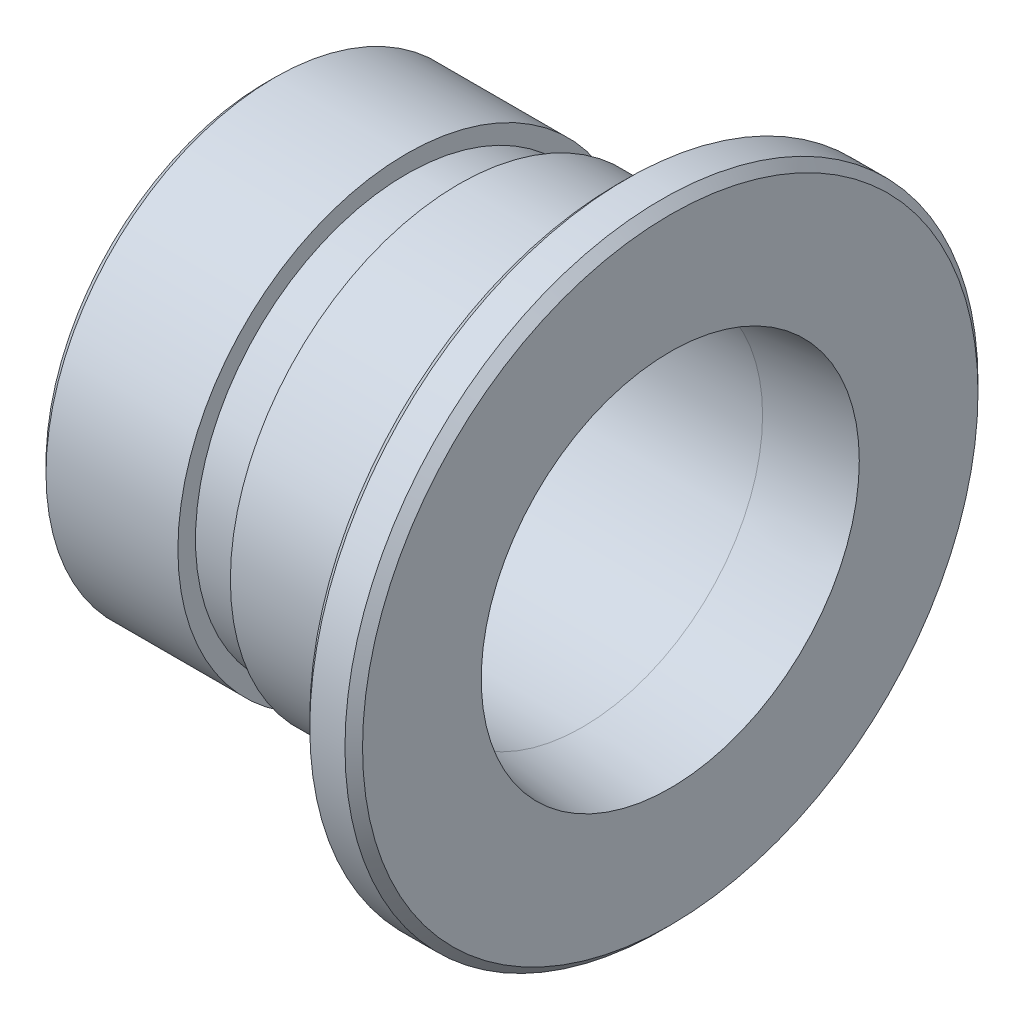
ISO-10303-21;
HEADER;
FILE_DESCRIPTION(('STEP AP214'),'2;1');
FILE_NAME('part.step','',(''),(''),'','','');
FILE_SCHEMA(('AUTOMOTIVE_DESIGN { 1 0 10303 214 1 1 1 1 }'));
ENDSEC;
DATA;
#1=APPLICATION_CONTEXT('core data for automotive mechanical design processes');
#2=APPLICATION_PROTOCOL_DEFINITION('international standard','automotive_design',2000,#1);
#3=PRODUCT_CONTEXT('',#1,'mechanical');
#4=PRODUCT('Part','Part','',(#3));
#5=PRODUCT_RELATED_PRODUCT_CATEGORY('part','',(#4));
#6=PRODUCT_DEFINITION_FORMATION('','',#4);
#7=PRODUCT_DEFINITION_CONTEXT('part definition',#1,'design');
#8=PRODUCT_DEFINITION('design','',#6,#7);
#9=PRODUCT_DEFINITION_SHAPE('','',#8);
#10=(LENGTH_UNIT() NAMED_UNIT(*) SI_UNIT(.MILLI.,.METRE.));
#11=(NAMED_UNIT(*) PLANE_ANGLE_UNIT() SI_UNIT($,.RADIAN.));
#12=(NAMED_UNIT(*) SI_UNIT($,.STERADIAN.) SOLID_ANGLE_UNIT());
#13=UNCERTAINTY_MEASURE_WITH_UNIT(LENGTH_MEASURE(1.E-05),#10,'distance_accuracy_value','');
#14=(GEOMETRIC_REPRESENTATION_CONTEXT(3) GLOBAL_UNCERTAINTY_ASSIGNED_CONTEXT((#13)) GLOBAL_UNIT_ASSIGNED_CONTEXT((#10,
#11,#12)) REPRESENTATION_CONTEXT('',''));
#15=CARTESIAN_POINT('',(0.,0.,0.));
#16=DIRECTION('',(0.,0.,1.));
#17=DIRECTION('',(1.,0.,0.));
#18=AXIS2_PLACEMENT_3D('',#15,#16,#17);
#19=CARTESIAN_POINT('',(0.,0.,0.));
#20=DIRECTION('',(1.,0.,0.));
#21=DIRECTION('',(0.,0.,-1.));
#22=AXIS2_PLACEMENT_3D('',#19,#20,#21);
#23=CYLINDRICAL_SURFACE('',#22,13.);
#24=CARTESIAN_POINT('',(-12.0158016342766,0.,0.));
#25=DIRECTION('',(1.,0.,0.));
#26=DIRECTION('',(0.,0.,-1.));
#27=AXIS2_PLACEMENT_3D('',#24,#25,#26);
#28=CIRCLE('',#27,13.);
#29=CARTESIAN_POINT('',(-12.0158016342766,0.,-13.));
#30=VERTEX_POINT('',#29);
#31=EDGE_CURVE('E94',#30,#30,#28,.T.);
#32=ORIENTED_EDGE('',*,*,#31,.T.);
#33=EDGE_LOOP('',(#32));
#34=FACE_BOUND('',#33,.T.);
#35=CARTESIAN_POINT('',(-3.,0.,0.));
#36=DIRECTION('',(1.,0.,0.));
#37=DIRECTION('',(0.,0.,-1.));
#38=AXIS2_PLACEMENT_3D('',#35,#36,#37);
#39=CIRCLE('',#38,13.);
#40=CARTESIAN_POINT('',(-3.,0.,-13.));
#41=VERTEX_POINT('',#40);
#42=EDGE_CURVE('E12',#41,#41,#39,.T.);
#43=ORIENTED_EDGE('',*,*,#42,.F.);
#44=EDGE_LOOP('',(#43));
#45=FACE_BOUND('',#44,.T.);
#46=ADVANCED_FACE('F45',(#34,#45),#23,.T.);
#47=CARTESIAN_POINT('',(-3.,17.5,0.));
#48=DIRECTION('',(-1.,0.,0.));
#49=DIRECTION('',(0.,0.,1.));
#50=AXIS2_PLACEMENT_3D('',#47,#48,#49);
#51=PLANE('',#50);
#52=ORIENTED_EDGE('',*,*,#42,.T.);
#53=EDGE_LOOP('',(#52));
#54=FACE_BOUND('',#53,.T.);
#55=CARTESIAN_POINT('',(-3.,0.,0.));
#56=DIRECTION('',(1.,0.,0.));
#57=DIRECTION('',(0.,0.,-1.));
#58=AXIS2_PLACEMENT_3D('',#55,#56,#57);
#59=CIRCLE('',#58,17.5);
#60=CARTESIAN_POINT('',(-3.,0.,-17.5));
#61=VERTEX_POINT('',#60);
#62=EDGE_CURVE('E51',#61,#61,#59,.T.);
#63=ORIENTED_EDGE('',*,*,#62,.F.);
#64=EDGE_LOOP('',(#63));
#65=FACE_BOUND('',#64,.T.);
#66=ADVANCED_FACE('F112',(#54,#65),#51,.T.);
#67=CARTESIAN_POINT('',(-2.5,0.,0.));
#68=DIRECTION('',(1.,0.,0.));
#69=DIRECTION('',(0.,0.,-1.));
#70=AXIS2_PLACEMENT_3D('',#67,#68,#69);
#71=CONICAL_SURFACE('',#70,18.,0.785398163397449);
#72=ORIENTED_EDGE('',*,*,#62,.T.);
#73=EDGE_LOOP('',(#72));
#74=FACE_BOUND('',#73,.T.);
#75=CARTESIAN_POINT('',(-2.5,0.,0.));
#76=DIRECTION('',(1.,0.,0.));
#77=DIRECTION('',(0.,0.,-1.));
#78=AXIS2_PLACEMENT_3D('',#75,#76,#77);
#79=CIRCLE('',#78,18.);
#80=CARTESIAN_POINT('',(-2.5,0.,-18.));
#81=VERTEX_POINT('',#80);
#82=EDGE_CURVE('E55',#81,#81,#79,.T.);
#83=ORIENTED_EDGE('',*,*,#82,.F.);
#84=EDGE_LOOP('',(#83));
#85=FACE_BOUND('',#84,.T.);
#86=ADVANCED_FACE('F116',(#74,#85),#71,.T.);
#87=CARTESIAN_POINT('',(0.,0.,0.));
#88=DIRECTION('',(1.,0.,0.));
#89=DIRECTION('',(0.,0.,-1.));
#90=AXIS2_PLACEMENT_3D('',#87,#88,#89);
#91=CYLINDRICAL_SURFACE('',#90,18.);
#92=ORIENTED_EDGE('',*,*,#82,.T.);
#93=EDGE_LOOP('',(#92));
#94=FACE_BOUND('',#93,.T.);
#95=CARTESIAN_POINT('',(-0.5,0.,0.));
#96=DIRECTION('',(1.,0.,0.));
#97=DIRECTION('',(0.,0.,-1.));
#98=AXIS2_PLACEMENT_3D('',#95,#96,#97);
#99=CIRCLE('',#98,18.);
#100=CARTESIAN_POINT('',(-0.5,0.,-18.));
#101=VERTEX_POINT('',#100);
#102=EDGE_CURVE('E59',#101,#101,#99,.T.);
#103=ORIENTED_EDGE('',*,*,#102,.F.);
#104=EDGE_LOOP('',(#103));
#105=FACE_BOUND('',#104,.T.);
#106=ADVANCED_FACE('F120',(#94,#105),#91,.T.);
#107=CARTESIAN_POINT('',(0.,0.,0.));
#108=DIRECTION('',(-1.,0.,0.));
#109=DIRECTION('',(0.,0.,1.));
#110=AXIS2_PLACEMENT_3D('',#107,#108,#109);
#111=CONICAL_SURFACE('',#110,17.5,0.785398163397449);
#112=ORIENTED_EDGE('',*,*,#102,.T.);
#113=EDGE_LOOP('',(#112));
#114=FACE_BOUND('',#113,.T.);
#115=CARTESIAN_POINT('',(0.,0.,0.));
#116=DIRECTION('',(1.,0.,0.));
#117=DIRECTION('',(0.,0.,-1.));
#118=AXIS2_PLACEMENT_3D('',#115,#116,#117);
#119=CIRCLE('',#118,17.5);
#120=CARTESIAN_POINT('',(0.,0.,-17.5));
#121=VERTEX_POINT('',#120);
#122=EDGE_CURVE('E64',#121,#121,#119,.T.);
#123=ORIENTED_EDGE('',*,*,#122,.F.);
#124=EDGE_LOOP('',(#123));
#125=FACE_BOUND('',#124,.T.);
#126=ADVANCED_FACE('F126',(#114,#125),#111,.T.);
#127=CARTESIAN_POINT('',(0.,10.75,0.));
#128=DIRECTION('',(1.,0.,0.));
#129=DIRECTION('',(0.,0.,-1.));
#130=AXIS2_PLACEMENT_3D('',#127,#128,#129);
#131=PLANE('',#130);
#132=ORIENTED_EDGE('',*,*,#122,.T.);
#133=EDGE_LOOP('',(#132));
#134=FACE_BOUND('',#133,.T.);
#135=CARTESIAN_POINT('',(0.,0.,0.));
#136=DIRECTION('',(1.,0.,0.));
#137=DIRECTION('',(0.,0.,-1.));
#138=AXIS2_PLACEMENT_3D('',#135,#136,#137);
#139=CIRCLE('',#138,10.75);
#140=CARTESIAN_POINT('',(0.,0.,-10.75));
#141=VERTEX_POINT('',#140);
#142=EDGE_CURVE('E67',#141,#141,#139,.T.);
#143=ORIENTED_EDGE('',*,*,#142,.F.);
#144=EDGE_LOOP('',(#143));
#145=FACE_BOUND('',#144,.T.);
#146=ADVANCED_FACE('F130',(#134,#145),#131,.T.);
#147=CARTESIAN_POINT('',(-5.,0.,0.));
#148=DIRECTION('',(1.,0.,0.));
#149=DIRECTION('',(0.,0.,-1.));
#150=AXIS2_PLACEMENT_3D('',#147,#148,#149);
#151=CONICAL_SURFACE('',#150,10.25,0.0996686524911638);
#152=ORIENTED_EDGE('',*,*,#142,.T.);
#153=EDGE_LOOP('',(#152));
#154=FACE_BOUND('',#153,.T.);
#155=CARTESIAN_POINT('',(-5.,0.,0.));
#156=DIRECTION('',(1.,0.,0.));
#157=DIRECTION('',(0.,0.,-1.));
#158=AXIS2_PLACEMENT_3D('',#155,#156,#157);
#159=CIRCLE('',#158,10.25);
#160=CARTESIAN_POINT('',(-5.,0.,-10.25));
#161=VERTEX_POINT('',#160);
#162=EDGE_CURVE('E70',#161,#161,#159,.T.);
#163=ORIENTED_EDGE('',*,*,#162,.F.);
#164=EDGE_LOOP('',(#163));
#165=FACE_BOUND('',#164,.T.);
#166=ADVANCED_FACE('F134',(#154,#165),#151,.F.);
#167=CARTESIAN_POINT('',(0.,0.,0.));
#168=DIRECTION('',(1.,0.,0.));
#169=DIRECTION('',(0.,0.,-1.));
#170=AXIS2_PLACEMENT_3D('',#167,#168,#169);
#171=CYLINDRICAL_SURFACE('',#170,10.25);
#172=ORIENTED_EDGE('',*,*,#162,.T.);
#173=EDGE_LOOP('',(#172));
#174=FACE_BOUND('',#173,.T.);
#175=CARTESIAN_POINT('',(-18.,0.,0.));
#176=DIRECTION('',(1.,0.,0.));
#177=DIRECTION('',(0.,0.,-1.));
#178=AXIS2_PLACEMENT_3D('',#175,#176,#177);
#179=CIRCLE('',#178,10.25);
#180=CARTESIAN_POINT('',(-18.,0.,-10.25));
#181=VERTEX_POINT('',#180);
#182=EDGE_CURVE('E73',#181,#181,#179,.T.);
#183=ORIENTED_EDGE('',*,*,#182,.F.);
#184=EDGE_LOOP('',(#183));
#185=FACE_BOUND('',#184,.T.);
#186=ADVANCED_FACE('F138',(#174,#185),#171,.F.);
#187=CARTESIAN_POINT('',(-23.,0.,0.));
#188=DIRECTION('',(-1.,0.,0.));
#189=DIRECTION('',(0.,0.,1.));
#190=AXIS2_PLACEMENT_3D('',#187,#188,#189);
#191=CONICAL_SURFACE('',#190,10.75,0.0996686524911635);
#192=ORIENTED_EDGE('',*,*,#182,.T.);
#193=EDGE_LOOP('',(#192));
#194=FACE_BOUND('',#193,.T.);
#195=CARTESIAN_POINT('',(-23.,0.,0.));
#196=DIRECTION('',(1.,0.,0.));
#197=DIRECTION('',(0.,0.,-1.));
#198=AXIS2_PLACEMENT_3D('',#195,#196,#197);
#199=CIRCLE('',#198,10.75);
#200=CARTESIAN_POINT('',(-23.,0.,-10.75));
#201=VERTEX_POINT('',#200);
#202=EDGE_CURVE('E76',#201,#201,#199,.T.);
#203=ORIENTED_EDGE('',*,*,#202,.F.);
#204=EDGE_LOOP('',(#203));
#205=FACE_BOUND('',#204,.T.);
#206=ADVANCED_FACE('F142',(#194,#205),#191,.F.);
#207=CARTESIAN_POINT('',(-23.,12.5,0.));
#208=DIRECTION('',(-1.,0.,0.));
#209=DIRECTION('',(0.,0.,1.));
#210=AXIS2_PLACEMENT_3D('',#207,#208,#209);
#211=PLANE('',#210);
#212=ORIENTED_EDGE('',*,*,#202,.T.);
#213=EDGE_LOOP('',(#212));
#214=FACE_BOUND('',#213,.T.);
#215=CARTESIAN_POINT('',(-23.,0.,0.));
#216=DIRECTION('',(1.,0.,0.));
#217=DIRECTION('',(0.,0.,-1.));
#218=AXIS2_PLACEMENT_3D('',#215,#216,#217);
#219=CIRCLE('',#218,12.5);
#220=CARTESIAN_POINT('',(-23.,0.,-12.5));
#221=VERTEX_POINT('',#220);
#222=EDGE_CURVE('E79',#221,#221,#219,.T.);
#223=ORIENTED_EDGE('',*,*,#222,.F.);
#224=EDGE_LOOP('',(#223));
#225=FACE_BOUND('',#224,.T.);
#226=ADVANCED_FACE('F146',(#214,#225),#211,.T.);
#227=CARTESIAN_POINT('',(-22.5,0.,0.));
#228=DIRECTION('',(1.,0.,0.));
#229=DIRECTION('',(0.,0.,-1.));
#230=AXIS2_PLACEMENT_3D('',#227,#228,#229);
#231=CONICAL_SURFACE('',#230,13.,0.785398163397448);
#232=ORIENTED_EDGE('',*,*,#222,.T.);
#233=EDGE_LOOP('',(#232));
#234=FACE_BOUND('',#233,.T.);
#235=CARTESIAN_POINT('',(-22.5,0.,0.));
#236=DIRECTION('',(1.,0.,0.));
#237=DIRECTION('',(0.,0.,-1.));
#238=AXIS2_PLACEMENT_3D('',#235,#236,#237);
#239=CIRCLE('',#238,13.);
#240=CARTESIAN_POINT('',(-22.5,0.,-13.));
#241=VERTEX_POINT('',#240);
#242=EDGE_CURVE('E82',#241,#241,#239,.T.);
#243=ORIENTED_EDGE('',*,*,#242,.F.);
#244=EDGE_LOOP('',(#243));
#245=FACE_BOUND('',#244,.T.);
#246=ADVANCED_FACE('F150',(#234,#245),#231,.T.);
#247=CARTESIAN_POINT('',(0.,0.,0.));
#248=DIRECTION('',(1.,0.,0.));
#249=DIRECTION('',(0.,0.,-1.));
#250=AXIS2_PLACEMENT_3D('',#247,#248,#249);
#251=CYLINDRICAL_SURFACE('',#250,13.);
#252=ORIENTED_EDGE('',*,*,#242,.T.);
#253=EDGE_LOOP('',(#252));
#254=FACE_BOUND('',#253,.T.);
#255=CARTESIAN_POINT('',(-15.,0.,0.));
#256=DIRECTION('',(1.,0.,0.));
#257=DIRECTION('',(0.,0.,-1.));
#258=AXIS2_PLACEMENT_3D('',#255,#256,#257);
#259=CIRCLE('',#258,13.);
#260=CARTESIAN_POINT('',(-15.,0.,-13.));
#261=VERTEX_POINT('',#260);
#262=EDGE_CURVE('E85',#261,#261,#259,.T.);
#263=ORIENTED_EDGE('',*,*,#262,.F.);
#264=EDGE_LOOP('',(#263));
#265=FACE_BOUND('',#264,.T.);
#266=ADVANCED_FACE('F154',(#254,#265),#251,.T.);
#267=CARTESIAN_POINT('',(-15.,12.,0.));
#268=DIRECTION('',(1.,0.,0.));
#269=DIRECTION('',(0.,0.,-1.));
#270=AXIS2_PLACEMENT_3D('',#267,#268,#269);
#271=PLANE('',#270);
#272=ORIENTED_EDGE('',*,*,#262,.T.);
#273=EDGE_LOOP('',(#272));
#274=FACE_BOUND('',#273,.T.);
#275=CARTESIAN_POINT('',(-15.,0.,0.));
#276=DIRECTION('',(1.,0.,0.));
#277=DIRECTION('',(0.,0.,-1.));
#278=AXIS2_PLACEMENT_3D('',#275,#276,#277);
#279=CIRCLE('',#278,12.);
#280=CARTESIAN_POINT('',(-15.,0.,-12.));
#281=VERTEX_POINT('',#280);
#282=EDGE_CURVE('E88',#281,#281,#279,.T.);
#283=ORIENTED_EDGE('',*,*,#282,.F.);
#284=EDGE_LOOP('',(#283));
#285=FACE_BOUND('',#284,.T.);
#286=ADVANCED_FACE('F108',(#274,#285),#271,.T.);
#287=CARTESIAN_POINT('',(0.,0.,0.));
#288=DIRECTION('',(1.,0.,0.));
#289=DIRECTION('',(0.,0.,-1.));
#290=AXIS2_PLACEMENT_3D('',#287,#288,#289);
#291=CYLINDRICAL_SURFACE('',#290,12.);
#292=ORIENTED_EDGE('',*,*,#282,.T.);
#293=EDGE_LOOP('',(#292));
#294=FACE_BOUND('',#293,.T.);
#295=CARTESIAN_POINT('',(-11.9841983657234,0.,0.));
#296=DIRECTION('',(1.,0.,0.));
#297=DIRECTION('',(0.,0.,-1.));
#298=AXIS2_PLACEMENT_3D('',#295,#296,#297);
#299=CIRCLE('',#298,12.);
#300=CARTESIAN_POINT('',(-11.9841983657234,0.,-12.));
#301=VERTEX_POINT('',#300);
#302=EDGE_CURVE('E91',#301,#301,#299,.T.);
#303=ORIENTED_EDGE('',*,*,#302,.F.);
#304=EDGE_LOOP('',(#303));
#305=FACE_BOUND('',#304,.T.);
#306=ADVANCED_FACE('F102',(#294,#305),#291,.T.);
#307=CARTESIAN_POINT('',(-12.0158016342766,0.,0.));
#308=DIRECTION('',(-1.,0.,0.));
#309=DIRECTION('',(0.,0.,1.));
#310=AXIS2_PLACEMENT_3D('',#307,#308,#309);
#311=CONICAL_SURFACE('',#310,13.,1.53920357337056);
#312=ORIENTED_EDGE('',*,*,#302,.T.);
#313=EDGE_LOOP('',(#312));
#314=FACE_BOUND('',#313,.T.);
#315=ORIENTED_EDGE('',*,*,#31,.F.);
#316=EDGE_LOOP('',(#315));
#317=FACE_BOUND('',#316,.T.);
#318=ADVANCED_FACE('F100',(#314,#317),#311,.F.);
#319=CLOSED_SHELL('',(#46,#66,#86,#106,#126,#146,#166,#186,#206,#226,#246,#266,#286,#306,#318));
#320=MANIFOLD_SOLID_BREP('B2',#319);
#321=ADVANCED_BREP_SHAPE_REPRESENTATION('',(#18,#320),#14);
#322=SHAPE_DEFINITION_REPRESENTATION(#9,#321);
ENDSEC;
END-ISO-10303-21;
